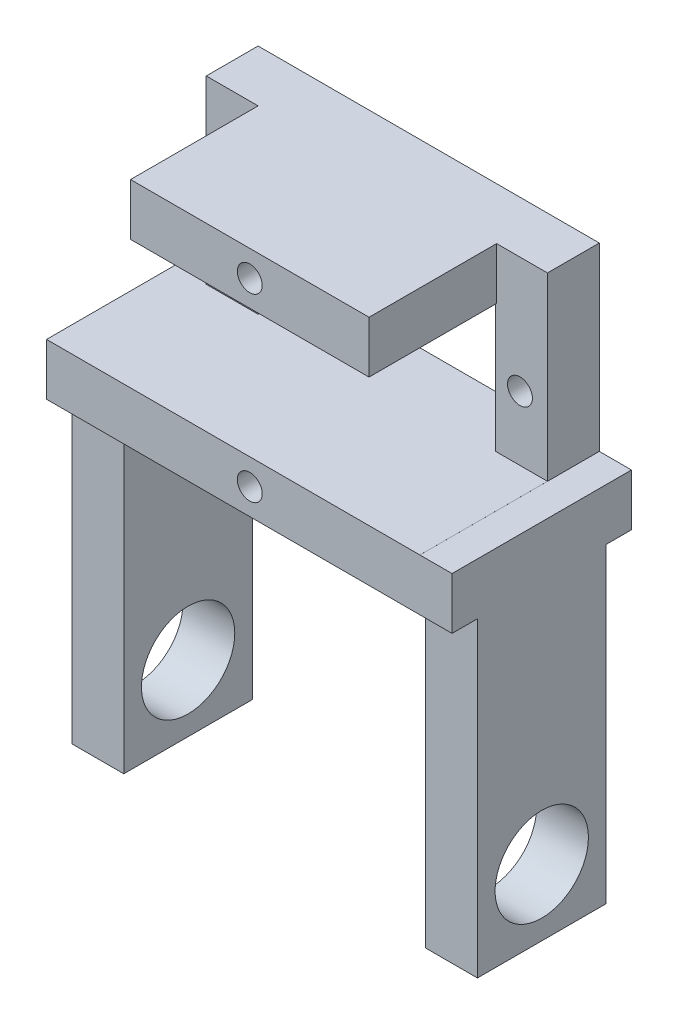
ISO-10303-21;
HEADER;
FILE_DESCRIPTION(('STEP AP214'),'2;1');
FILE_NAME('part.step','',(''),(''),'','','');
FILE_SCHEMA(('AUTOMOTIVE_DESIGN { 1 0 10303 214 1 1 1 1 }'));
ENDSEC;
DATA;
#1=APPLICATION_CONTEXT('core data for automotive mechanical design processes');
#2=APPLICATION_PROTOCOL_DEFINITION('international standard','automotive_design',2000,#1);
#3=PRODUCT_CONTEXT('',#1,'mechanical');
#4=PRODUCT('Part','Part','',(#3));
#5=PRODUCT_RELATED_PRODUCT_CATEGORY('part','',(#4));
#6=PRODUCT_DEFINITION_FORMATION('','',#4);
#7=PRODUCT_DEFINITION_CONTEXT('part definition',#1,'design');
#8=PRODUCT_DEFINITION('design','',#6,#7);
#9=PRODUCT_DEFINITION_SHAPE('','',#8);
#10=(LENGTH_UNIT() NAMED_UNIT(*) SI_UNIT(.MILLI.,.METRE.));
#11=(NAMED_UNIT(*) PLANE_ANGLE_UNIT() SI_UNIT($,.RADIAN.));
#12=(NAMED_UNIT(*) SI_UNIT($,.STERADIAN.) SOLID_ANGLE_UNIT());
#13=UNCERTAINTY_MEASURE_WITH_UNIT(LENGTH_MEASURE(1.E-05),#10,'distance_accuracy_value','');
#14=(GEOMETRIC_REPRESENTATION_CONTEXT(3) GLOBAL_UNCERTAINTY_ASSIGNED_CONTEXT((#13)) GLOBAL_UNIT_ASSIGNED_CONTEXT((#10,
#11,#12)) REPRESENTATION_CONTEXT('',''));
#15=CARTESIAN_POINT('',(0.,0.,0.));
#16=DIRECTION('',(0.,0.,1.));
#17=DIRECTION('',(1.,0.,0.));
#18=AXIS2_PLACEMENT_3D('',#15,#16,#17);
#19=CARTESIAN_POINT('',(-16.45,-11.2,5.));
#20=DIRECTION('',(0.,1.,0.));
#21=DIRECTION('',(0.,0.,1.));
#22=AXIS2_PLACEMENT_3D('',#19,#20,#21);
#23=PLANE('',#22);
#24=DIRECTION('',(-1.,0.,0.));
#25=VECTOR('',#24,1.);
#26=CARTESIAN_POINT('',(14.55,-11.2,14.85));
#27=LINE('',#26,#25);
#28=CARTESIAN_POINT('',(19.55,-11.2,14.85));
#29=VERTEX_POINT('',#28);
#30=CARTESIAN_POINT('',(14.55,-11.2,14.85));
#31=VERTEX_POINT('',#30);
#32=EDGE_CURVE('E303',#29,#31,#27,.T.);
#33=ORIENTED_EDGE('',*,*,#32,.F.);
#34=DIRECTION('',(0.,0.,-1.));
#35=VECTOR('',#34,1.);
#36=CARTESIAN_POINT('',(19.55,-11.2,17.3));
#37=LINE('',#36,#35);
#38=CARTESIAN_POINT('',(19.55,-11.2,17.3));
#39=VERTEX_POINT('',#38);
#40=EDGE_CURVE('E391',#39,#29,#37,.T.);
#41=ORIENTED_EDGE('',*,*,#40,.F.);
#42=DIRECTION('',(1.,0.,0.));
#43=VECTOR('',#42,1.);
#44=CARTESIAN_POINT('',(-11.45,-11.2,17.3));
#45=LINE('',#44,#43);
#46=CARTESIAN_POINT('',(-19.55,-11.2,17.3));
#47=VERTEX_POINT('',#46);
#48=EDGE_CURVE('E440',#47,#39,#45,.T.);
#49=ORIENTED_EDGE('',*,*,#48,.F.);
#50=DIRECTION('',(0.,0.,1.));
#51=VECTOR('',#50,1.);
#52=CARTESIAN_POINT('',(-19.55,-11.2,0.));
#53=LINE('',#52,#51);
#54=CARTESIAN_POINT('',(-19.55,-11.2,14.85));
#55=VERTEX_POINT('',#54);
#56=EDGE_CURVE('E369',#55,#47,#53,.T.);
#57=ORIENTED_EDGE('',*,*,#56,.F.);
#58=DIRECTION('',(-1.,0.,0.));
#59=VECTOR('',#58,1.);
#60=CARTESIAN_POINT('',(-14.55,-11.2,14.85));
#61=LINE('',#60,#59);
#62=CARTESIAN_POINT('',(-14.55,-11.2,14.85));
#63=VERTEX_POINT('',#62);
#64=EDGE_CURVE('E330',#63,#55,#61,.T.);
#65=ORIENTED_EDGE('',*,*,#64,.F.);
#66=DIRECTION('',(0.,0.,1.));
#67=VECTOR('',#66,1.);
#68=CARTESIAN_POINT('',(-14.55,-11.2,2.45));
#69=LINE('',#68,#67);
#70=CARTESIAN_POINT('',(-14.55,-11.2,2.45));
#71=VERTEX_POINT('',#70);
#72=EDGE_CURVE('E343',#71,#63,#69,.T.);
#73=ORIENTED_EDGE('',*,*,#72,.F.);
#74=DIRECTION('',(1.,0.,0.));
#75=VECTOR('',#74,1.);
#76=CARTESIAN_POINT('',(-14.55,-11.2,2.45));
#77=LINE('',#76,#75);
#78=CARTESIAN_POINT('',(-19.55,-11.2,2.45));
#79=VERTEX_POINT('',#78);
#80=EDGE_CURVE('E324',#79,#71,#77,.T.);
#81=ORIENTED_EDGE('',*,*,#80,.F.);
#82=CARTESIAN_POINT('',(-19.55,-11.2,0.));
#83=VERTEX_POINT('',#82);
#84=EDGE_CURVE('E370',#83,#79,#53,.T.);
#85=ORIENTED_EDGE('',*,*,#84,.F.);
#86=DIRECTION('',(1.,0.,0.));
#87=VECTOR('',#86,1.);
#88=CARTESIAN_POINT('',(-16.45,-11.2,0.));
#89=LINE('',#88,#87);
#90=CARTESIAN_POINT('',(19.55,-11.2,0.));
#91=VERTEX_POINT('',#90);
#92=EDGE_CURVE('E549',#83,#91,#89,.T.);
#93=ORIENTED_EDGE('',*,*,#92,.T.);
#94=CARTESIAN_POINT('',(19.55,-11.2,2.45));
#95=VERTEX_POINT('',#94);
#96=EDGE_CURVE('E390',#95,#91,#37,.T.);
#97=ORIENTED_EDGE('',*,*,#96,.F.);
#98=DIRECTION('',(1.,0.,0.));
#99=VECTOR('',#98,1.);
#100=CARTESIAN_POINT('',(14.55,-11.2,2.45));
#101=LINE('',#100,#99);
#102=CARTESIAN_POINT('',(14.55,-11.2,2.45));
#103=VERTEX_POINT('',#102);
#104=EDGE_CURVE('E294',#103,#95,#101,.T.);
#105=ORIENTED_EDGE('',*,*,#104,.F.);
#106=DIRECTION('',(0.,0.,-1.));
#107=VECTOR('',#106,1.);
#108=CARTESIAN_POINT('',(14.55,-11.2,2.45));
#109=LINE('',#108,#107);
#110=EDGE_CURVE('E306',#31,#103,#109,.T.);
#111=ORIENTED_EDGE('',*,*,#110,.F.);
#112=EDGE_LOOP('',(#33,#41,#49,#57,#65,#73,#81,#85,#93,#97,#105,#111));
#113=FACE_BOUND('',#112,.T.);
#114=ADVANCED_FACE('F40',(#113),#23,.F.);
#115=CARTESIAN_POINT('',(-16.45,11.2,5.));
#116=DIRECTION('',(1.,0.,0.));
#117=DIRECTION('',(0.,1.,0.));
#118=AXIS2_PLACEMENT_3D('',#115,#116,#117);
#119=PLANE('',#118);
#120=DIRECTION('',(0.,0.,-1.));
#121=VECTOR('',#120,1.);
#122=CARTESIAN_POINT('',(-16.45,-6.2,0.));
#123=LINE('',#122,#121);
#124=CARTESIAN_POINT('',(-16.45,-6.20000000000001,5.));
#125=VERTEX_POINT('',#124);
#126=CARTESIAN_POINT('',(-16.45,-6.2,0.));
#127=VERTEX_POINT('',#126);
#128=EDGE_CURVE('E11',#125,#127,#123,.T.);
#129=ORIENTED_EDGE('',*,*,#128,.F.);
#130=DIRECTION('',(0.,-1.,0.));
#131=VECTOR('',#130,1.);
#132=CARTESIAN_POINT('',(-16.45,11.2,5.));
#133=LINE('',#132,#131);
#134=CARTESIAN_POINT('',(-16.45,11.2,5.));
#135=VERTEX_POINT('',#134);
#136=EDGE_CURVE('E553',#135,#125,#133,.T.);
#137=ORIENTED_EDGE('',*,*,#136,.F.);
#138=DIRECTION('',(0.,0.,-1.));
#139=VECTOR('',#138,1.);
#140=CARTESIAN_POINT('',(-16.45,11.2,5.));
#141=LINE('',#140,#139);
#142=CARTESIAN_POINT('',(-16.45,11.2,0.));
#143=VERTEX_POINT('',#142);
#144=EDGE_CURVE('E557',#135,#143,#141,.T.);
#145=ORIENTED_EDGE('',*,*,#144,.T.);
#146=DIRECTION('',(0.,-1.,0.));
#147=VECTOR('',#146,1.);
#148=CARTESIAN_POINT('',(-16.45,11.2,0.));
#149=LINE('',#148,#147);
#150=EDGE_CURVE('E563',#143,#127,#149,.T.);
#151=ORIENTED_EDGE('',*,*,#150,.T.);
#152=EDGE_LOOP('',(#129,#137,#145,#151));
#153=FACE_BOUND('',#152,.T.);
#154=ADVANCED_FACE('F590',(#153),#119,.F.);
#155=CARTESIAN_POINT('',(16.45,11.2,5.));
#156=DIRECTION('',(-1.,0.,0.));
#157=DIRECTION('',(0.,0.,1.));
#158=AXIS2_PLACEMENT_3D('',#155,#156,#157);
#159=PLANE('',#158);
#160=DIRECTION('',(0.,0.,1.));
#161=VECTOR('',#160,1.);
#162=CARTESIAN_POINT('',(16.45,-6.20179511261654,17.3));
#163=LINE('',#162,#161);
#164=CARTESIAN_POINT('',(16.45,-6.20179511261654,0.));
#165=VERTEX_POINT('',#164);
#166=CARTESIAN_POINT('',(16.45,-6.20179511261654,17.3));
#167=VERTEX_POINT('',#166);
#168=EDGE_CURVE('E385',#165,#167,#163,.T.);
#169=ORIENTED_EDGE('',*,*,#168,.F.);
#170=DIRECTION('',(0.,1.,0.));
#171=VECTOR('',#170,1.);
#172=CARTESIAN_POINT('',(16.45,11.2,0.));
#173=LINE('',#172,#171);
#174=CARTESIAN_POINT('',(16.45,11.2,0.));
#175=VERTEX_POINT('',#174);
#176=EDGE_CURVE('E534',#165,#175,#173,.T.);
#177=ORIENTED_EDGE('',*,*,#176,.T.);
#178=DIRECTION('',(0.,0.,-1.));
#179=VECTOR('',#178,1.);
#180=CARTESIAN_POINT('',(16.45,11.2,5.));
#181=LINE('',#180,#179);
#182=CARTESIAN_POINT('',(16.45,11.2,5.));
#183=VERTEX_POINT('',#182);
#184=EDGE_CURVE('E470',#183,#175,#181,.T.);
#185=ORIENTED_EDGE('',*,*,#184,.F.);
#186=DIRECTION('',(0.,1.,0.));
#187=VECTOR('',#186,1.);
#188=CARTESIAN_POINT('',(16.45,11.2,5.));
#189=LINE('',#188,#187);
#190=CARTESIAN_POINT('',(16.45,-6.2,5.));
#191=VERTEX_POINT('',#190);
#192=EDGE_CURVE('E545',#191,#183,#189,.T.);
#193=ORIENTED_EDGE('',*,*,#192,.F.);
#194=DIRECTION('',(0.,0.,-1.));
#195=VECTOR('',#194,1.);
#196=CARTESIAN_POINT('',(16.45,-6.2,17.3));
#197=LINE('',#196,#195);
#198=CARTESIAN_POINT('',(16.45,-6.2,17.3));
#199=VERTEX_POINT('',#198);
#200=EDGE_CURVE('E415',#199,#191,#197,.T.);
#201=ORIENTED_EDGE('',*,*,#200,.F.);
#202=DIRECTION('',(0.,1.,0.));
#203=VECTOR('',#202,1.);
#204=CARTESIAN_POINT('',(16.45,-11.2,17.3));
#205=LINE('',#204,#203);
#206=EDGE_CURVE('E412',#167,#199,#205,.T.);
#207=ORIENTED_EDGE('',*,*,#206,.F.);
#208=EDGE_LOOP('',(#169,#177,#185,#193,#201,#207));
#209=FACE_BOUND('',#208,.T.);
#210=ADVANCED_FACE('F42',(#209),#159,.F.);
#211=CARTESIAN_POINT('',(0.,0.,5.));
#212=DIRECTION('',(0.,0.,1.));
#213=DIRECTION('',(1.,0.,0.));
#214=AXIS2_PLACEMENT_3D('',#211,#212,#213);
#215=PLANE('',#214);
#216=CARTESIAN_POINT('',(13.8,0.,5.));
#217=DIRECTION('',(0.,0.,1.));
#218=DIRECTION('',(1.,0.,0.));
#219=AXIS2_PLACEMENT_3D('',#216,#217,#218);
#220=CIRCLE('',#219,1.2);
#221=CARTESIAN_POINT('',(15.,0.,5.));
#222=VERTEX_POINT('',#221);
#223=EDGE_CURVE('E495',#222,#222,#220,.T.);
#224=ORIENTED_EDGE('',*,*,#223,.F.);
#225=EDGE_LOOP('',(#224));
#226=FACE_BOUND('',#225,.T.);
#227=DIRECTION('',(-1.,0.,0.));
#228=VECTOR('',#227,1.);
#229=CARTESIAN_POINT('',(-11.45,-6.2,5.));
#230=LINE('',#229,#228);
#231=CARTESIAN_POINT('',(11.45,-6.2,5.));
#232=VERTEX_POINT('',#231);
#233=EDGE_CURVE('E428',#191,#232,#230,.T.);
#234=ORIENTED_EDGE('',*,*,#233,.F.);
#235=ORIENTED_EDGE('',*,*,#192,.T.);
#236=DIRECTION('',(-1.,0.,0.));
#237=VECTOR('',#236,1.);
#238=CARTESIAN_POINT('',(-16.45,11.2,5.));
#239=LINE('',#238,#237);
#240=CARTESIAN_POINT('',(11.546888994161,11.2,5.));
#241=VERTEX_POINT('',#240);
#242=EDGE_CURVE('E550',#183,#241,#239,.T.);
#243=ORIENTED_EDGE('',*,*,#242,.T.);
#244=DIRECTION('',(0.,1.,0.));
#245=VECTOR('',#244,1.);
#246=CARTESIAN_POINT('',(11.546888994161,6.2,5.));
#247=LINE('',#246,#245);
#248=CARTESIAN_POINT('',(11.546888994161,6.2,5.));
#249=VERTEX_POINT('',#248);
#250=EDGE_CURVE('E454',#249,#241,#247,.T.);
#251=ORIENTED_EDGE('',*,*,#250,.F.);
#252=DIRECTION('',(1.,0.,0.));
#253=VECTOR('',#252,1.);
#254=CARTESIAN_POINT('',(-11.45,6.2,5.));
#255=LINE('',#254,#253);
#256=CARTESIAN_POINT('',(11.45,6.2,5.));
#257=VERTEX_POINT('',#256);
#258=EDGE_CURVE('E50',#257,#249,#255,.T.);
#259=ORIENTED_EDGE('',*,*,#258,.F.);
#260=DIRECTION('',(0.,1.,0.));
#261=VECTOR('',#260,1.);
#262=CARTESIAN_POINT('',(11.45,6.2,5.));
#263=LINE('',#262,#261);
#264=EDGE_CURVE('E494',#232,#257,#263,.T.);
#265=ORIENTED_EDGE('',*,*,#264,.F.);
#266=EDGE_LOOP('',(#234,#235,#243,#251,#259,#265));
#267=FACE_BOUND('',#266,.T.);
#268=ADVANCED_FACE('F644',(#226,#267),#215,.T.);
#269=CARTESIAN_POINT('',(-13.8,0.,5.));
#270=DIRECTION('',(0.,0.,1.));
#271=DIRECTION('',(1.,0.,0.));
#272=AXIS2_PLACEMENT_3D('',#269,#270,#271);
#273=CIRCLE('',#272,1.2);
#274=CARTESIAN_POINT('',(-12.6,0.,5.));
#275=VERTEX_POINT('',#274);
#276=EDGE_CURVE('E489',#275,#275,#273,.T.);
#277=ORIENTED_EDGE('',*,*,#276,.F.);
#278=EDGE_LOOP('',(#277));
#279=FACE_BOUND('',#278,.T.);
#280=ORIENTED_EDGE('',*,*,#136,.T.);
#281=DIRECTION('',(-1.,0.,0.));
#282=VECTOR('',#281,1.);
#283=CARTESIAN_POINT('',(-16.45,-6.20000000000001,5.));
#284=LINE('',#283,#282);
#285=CARTESIAN_POINT('',(-11.45,-6.20000000000001,5.));
#286=VERTEX_POINT('',#285);
#287=EDGE_CURVE('E419',#286,#125,#284,.T.);
#288=ORIENTED_EDGE('',*,*,#287,.F.);
#289=DIRECTION('',(0.,-1.,0.));
#290=VECTOR('',#289,1.);
#291=CARTESIAN_POINT('',(-11.45,6.2,5.));
#292=LINE('',#291,#290);
#293=CARTESIAN_POINT('',(-11.45,6.2,5.));
#294=VERTEX_POINT('',#293);
#295=EDGE_CURVE('E511',#294,#286,#292,.T.);
#296=ORIENTED_EDGE('',*,*,#295,.F.);
#297=DIRECTION('',(0.,-1.,0.));
#298=VECTOR('',#297,1.);
#299=CARTESIAN_POINT('',(-11.45,6.2,5.));
#300=LINE('',#299,#298);
#301=CARTESIAN_POINT('',(-11.45,11.2,5.));
#302=VERTEX_POINT('',#301);
#303=EDGE_CURVE('E446',#302,#294,#300,.T.);
#304=ORIENTED_EDGE('',*,*,#303,.F.);
#305=EDGE_CURVE('E548',#302,#135,#239,.T.);
#306=ORIENTED_EDGE('',*,*,#305,.T.);
#307=EDGE_LOOP('',(#280,#288,#296,#304,#306));
#308=FACE_BOUND('',#307,.T.);
#309=ADVANCED_FACE('F598',(#279,#308),#215,.T.);
#310=CARTESIAN_POINT('',(-16.45,11.2,5.));
#311=DIRECTION('',(0.,-1.,0.));
#312=DIRECTION('',(0.,0.,-1.));
#313=AXIS2_PLACEMENT_3D('',#310,#311,#312);
#314=PLANE('',#313);
#315=DIRECTION('',(-1.,0.,0.));
#316=VECTOR('',#315,1.);
#317=CARTESIAN_POINT('',(-16.45,11.2,0.));
#318=LINE('',#317,#316);
#319=EDGE_CURVE('E560',#175,#143,#318,.T.);
#320=ORIENTED_EDGE('',*,*,#319,.T.);
#321=ORIENTED_EDGE('',*,*,#144,.F.);
#322=ORIENTED_EDGE('',*,*,#305,.F.);
#323=DIRECTION('',(0.,0.,-1.));
#324=VECTOR('',#323,1.);
#325=CARTESIAN_POINT('',(-11.45,11.2,17.3));
#326=LINE('',#325,#324);
#327=CARTESIAN_POINT('',(-11.45,11.2,17.3));
#328=VERTEX_POINT('',#327);
#329=EDGE_CURVE('E463',#328,#302,#326,.T.);
#330=ORIENTED_EDGE('',*,*,#329,.F.);
#331=DIRECTION('',(-1.,0.,0.));
#332=VECTOR('',#331,1.);
#333=CARTESIAN_POINT('',(-11.45,11.2,17.3));
#334=LINE('',#333,#332);
#335=CARTESIAN_POINT('',(11.546888994161,11.2,17.3));
#336=VERTEX_POINT('',#335);
#337=EDGE_CURVE('E460',#336,#328,#334,.T.);
#338=ORIENTED_EDGE('',*,*,#337,.F.);
#339=DIRECTION('',(0.,0.,-1.));
#340=VECTOR('',#339,1.);
#341=CARTESIAN_POINT('',(11.546888994161,11.2,17.3));
#342=LINE('',#341,#340);
#343=EDGE_CURVE('E477',#336,#241,#342,.T.);
#344=ORIENTED_EDGE('',*,*,#343,.T.);
#345=ORIENTED_EDGE('',*,*,#242,.F.);
#346=ORIENTED_EDGE('',*,*,#184,.T.);
#347=EDGE_LOOP('',(#320,#321,#322,#330,#338,#344,#345,#346));
#348=FACE_BOUND('',#347,.T.);
#349=ADVANCED_FACE('F576',(#348),#314,.F.);
#350=CARTESIAN_POINT('',(0.,0.,0.));
#351=DIRECTION('',(0.,0.,1.));
#352=DIRECTION('',(1.,0.,0.));
#353=AXIS2_PLACEMENT_3D('',#350,#351,#352);
#354=PLANE('',#353);
#355=CARTESIAN_POINT('',(-13.8,0.,0.));
#356=DIRECTION('',(0.,0.,1.));
#357=DIRECTION('',(1.,0.,0.));
#358=AXIS2_PLACEMENT_3D('',#355,#356,#357);
#359=CIRCLE('',#358,1.2);
#360=CARTESIAN_POINT('',(-12.6,0.,0.));
#361=VERTEX_POINT('',#360);
#362=EDGE_CURVE('E499',#361,#361,#359,.T.);
#363=ORIENTED_EDGE('',*,*,#362,.T.);
#364=EDGE_LOOP('',(#363));
#365=FACE_BOUND('',#364,.T.);
#366=CARTESIAN_POINT('',(13.8,0.,0.));
#367=DIRECTION('',(0.,0.,1.));
#368=DIRECTION('',(1.,0.,0.));
#369=AXIS2_PLACEMENT_3D('',#366,#367,#368);
#370=CIRCLE('',#369,1.2);
#371=CARTESIAN_POINT('',(15.,0.,0.));
#372=VERTEX_POINT('',#371);
#373=EDGE_CURVE('E490',#372,#372,#370,.T.);
#374=ORIENTED_EDGE('',*,*,#373,.T.);
#375=EDGE_LOOP('',(#374));
#376=FACE_BOUND('',#375,.T.);
#377=DIRECTION('',(1.,0.,0.));
#378=VECTOR('',#377,1.);
#379=CARTESIAN_POINT('',(-11.45,-6.2,0.));
#380=LINE('',#379,#378);
#381=CARTESIAN_POINT('',(-11.45,-6.2,0.));
#382=VERTEX_POINT('',#381);
#383=CARTESIAN_POINT('',(11.45,-6.2,0.));
#384=VERTEX_POINT('',#383);
#385=EDGE_CURVE('E519',#382,#384,#380,.T.);
#386=ORIENTED_EDGE('',*,*,#385,.T.);
#387=DIRECTION('',(0.,1.,0.));
#388=VECTOR('',#387,1.);
#389=CARTESIAN_POINT('',(11.45,6.2,0.));
#390=LINE('',#389,#388);
#391=CARTESIAN_POINT('',(11.45,6.2,0.));
#392=VERTEX_POINT('',#391);
#393=EDGE_CURVE('E506',#384,#392,#390,.T.);
#394=ORIENTED_EDGE('',*,*,#393,.T.);
#395=DIRECTION('',(-1.,0.,0.));
#396=VECTOR('',#395,1.);
#397=CARTESIAN_POINT('',(-11.45,6.2,0.));
#398=LINE('',#397,#396);
#399=CARTESIAN_POINT('',(-11.45,6.2,0.));
#400=VERTEX_POINT('',#399);
#401=EDGE_CURVE('E510',#392,#400,#398,.T.);
#402=ORIENTED_EDGE('',*,*,#401,.T.);
#403=DIRECTION('',(0.,-1.,0.));
#404=VECTOR('',#403,1.);
#405=CARTESIAN_POINT('',(-11.45,6.2,0.));
#406=LINE('',#405,#404);
#407=EDGE_CURVE('E515',#400,#382,#406,.T.);
#408=ORIENTED_EDGE('',*,*,#407,.T.);
#409=EDGE_LOOP('',(#386,#394,#402,#408));
#410=FACE_BOUND('',#409,.T.);
#411=ORIENTED_EDGE('',*,*,#176,.F.);
#412=DIRECTION('',(-1.,0.,0.));
#413=VECTOR('',#412,1.);
#414=CARTESIAN_POINT('',(19.55,-6.20179511261654,0.));
#415=LINE('',#414,#413);
#416=CARTESIAN_POINT('',(19.55,-6.20179511261654,0.));
#417=VERTEX_POINT('',#416);
#418=EDGE_CURVE('E408',#417,#165,#415,.T.);
#419=ORIENTED_EDGE('',*,*,#418,.F.);
#420=DIRECTION('',(0.,1.,0.));
#421=VECTOR('',#420,1.);
#422=CARTESIAN_POINT('',(19.55,-11.2,0.));
#423=LINE('',#422,#421);
#424=EDGE_CURVE('E395',#91,#417,#423,.T.);
#425=ORIENTED_EDGE('',*,*,#424,.F.);
#426=ORIENTED_EDGE('',*,*,#92,.F.);
#427=DIRECTION('',(0.,-1.,0.));
#428=VECTOR('',#427,1.);
#429=CARTESIAN_POINT('',(-19.55,-11.2,0.));
#430=LINE('',#429,#428);
#431=CARTESIAN_POINT('',(-19.55,-6.2,0.));
#432=VERTEX_POINT('',#431);
#433=EDGE_CURVE('E365',#432,#83,#430,.T.);
#434=ORIENTED_EDGE('',*,*,#433,.F.);
#435=DIRECTION('',(1.,0.,0.));
#436=VECTOR('',#435,1.);
#437=CARTESIAN_POINT('',(-19.55,-6.2,0.));
#438=LINE('',#437,#436);
#439=EDGE_CURVE('E380',#432,#127,#438,.T.);
#440=ORIENTED_EDGE('',*,*,#439,.T.);
#441=ORIENTED_EDGE('',*,*,#150,.F.);
#442=ORIENTED_EDGE('',*,*,#319,.F.);
#443=EDGE_LOOP('',(#411,#419,#425,#426,#434,#440,#441,#442));
#444=FACE_BOUND('',#443,.T.);
#445=ADVANCED_FACE('F586',(#365,#376,#410,#444),#354,.F.);
#446=CARTESIAN_POINT('',(11.45,6.2,0.));
#447=DIRECTION('',(1.,0.,0.));
#448=DIRECTION('',(0.,0.,-1.));
#449=AXIS2_PLACEMENT_3D('',#446,#447,#448);
#450=PLANE('',#449);
#451=ORIENTED_EDGE('',*,*,#264,.T.);
#452=DIRECTION('',(0.,0.,1.));
#453=VECTOR('',#452,1.);
#454=CARTESIAN_POINT('',(11.45,6.2,0.));
#455=LINE('',#454,#453);
#456=EDGE_CURVE('E523',#392,#257,#455,.T.);
#457=ORIENTED_EDGE('',*,*,#456,.F.);
#458=ORIENTED_EDGE('',*,*,#393,.F.);
#459=DIRECTION('',(0.,0.,1.));
#460=VECTOR('',#459,1.);
#461=CARTESIAN_POINT('',(11.45,-6.2,0.));
#462=LINE('',#461,#460);
#463=EDGE_CURVE('E530',#384,#232,#462,.T.);
#464=ORIENTED_EDGE('',*,*,#463,.T.);
#465=EDGE_LOOP('',(#451,#457,#458,#464));
#466=FACE_BOUND('',#465,.T.);
#467=ADVANCED_FACE('F642',(#466),#450,.F.);
#468=CARTESIAN_POINT('',(-11.45,-6.2,0.));
#469=DIRECTION('',(0.,-1.,0.));
#470=DIRECTION('',(0.,0.,-1.));
#471=AXIS2_PLACEMENT_3D('',#468,#469,#470);
#472=PLANE('',#471);
#473=DIRECTION('',(0.,0.,1.));
#474=VECTOR('',#473,1.);
#475=CARTESIAN_POINT('',(-11.45,-6.2,0.));
#476=LINE('',#475,#474);
#477=EDGE_CURVE('E535',#382,#286,#476,.T.);
#478=ORIENTED_EDGE('',*,*,#477,.T.);
#479=ORIENTED_EDGE('',*,*,#287,.T.);
#480=ORIENTED_EDGE('',*,*,#128,.T.);
#481=ORIENTED_EDGE('',*,*,#439,.F.);
#482=DIRECTION('',(0.,0.,-1.));
#483=VECTOR('',#482,1.);
#484=CARTESIAN_POINT('',(-19.55,-6.2,0.));
#485=LINE('',#484,#483);
#486=CARTESIAN_POINT('',(-19.55,-6.2,17.3));
#487=VERTEX_POINT('',#486);
#488=EDGE_CURVE('E378',#487,#432,#485,.T.);
#489=ORIENTED_EDGE('',*,*,#488,.F.);
#490=DIRECTION('',(-1.,0.,0.));
#491=VECTOR('',#490,1.);
#492=CARTESIAN_POINT('',(-11.45,-6.2,17.3));
#493=LINE('',#492,#491);
#494=EDGE_CURVE('E443',#199,#487,#493,.T.);
#495=ORIENTED_EDGE('',*,*,#494,.F.);
#496=ORIENTED_EDGE('',*,*,#200,.T.);
#497=ORIENTED_EDGE('',*,*,#233,.T.);
#498=ORIENTED_EDGE('',*,*,#463,.F.);
#499=ORIENTED_EDGE('',*,*,#385,.F.);
#500=EDGE_LOOP('',(#478,#479,#480,#481,#489,#495,#496,#497,#498,#499));
#501=FACE_BOUND('',#500,.T.);
#502=ADVANCED_FACE('F593',(#501),#472,.F.);
#503=CARTESIAN_POINT('',(-11.45,6.2,0.));
#504=DIRECTION('',(-1.,0.,0.));
#505=DIRECTION('',(0.,0.,1.));
#506=AXIS2_PLACEMENT_3D('',#503,#504,#505);
#507=PLANE('',#506);
#508=ORIENTED_EDGE('',*,*,#295,.T.);
#509=ORIENTED_EDGE('',*,*,#477,.F.);
#510=ORIENTED_EDGE('',*,*,#407,.F.);
#511=DIRECTION('',(0.,0.,1.));
#512=VECTOR('',#511,1.);
#513=CARTESIAN_POINT('',(-11.45,6.2,0.));
#514=LINE('',#513,#512);
#515=EDGE_CURVE('E539',#400,#294,#514,.T.);
#516=ORIENTED_EDGE('',*,*,#515,.T.);
#517=EDGE_LOOP('',(#508,#509,#510,#516));
#518=FACE_BOUND('',#517,.T.);
#519=ADVANCED_FACE('F659',(#518),#507,.F.);
#520=CARTESIAN_POINT('',(-11.45,6.2,0.));
#521=DIRECTION('',(0.,1.,0.));
#522=DIRECTION('',(0.,0.,1.));
#523=AXIS2_PLACEMENT_3D('',#520,#521,#522);
#524=PLANE('',#523);
#525=ORIENTED_EDGE('',*,*,#456,.T.);
#526=ORIENTED_EDGE('',*,*,#258,.T.);
#527=DIRECTION('',(0.,0.,-1.));
#528=VECTOR('',#527,1.);
#529=CARTESIAN_POINT('',(11.546888994161,6.2,17.3));
#530=LINE('',#529,#528);
#531=CARTESIAN_POINT('',(11.546888994161,6.2,17.3));
#532=VERTEX_POINT('',#531);
#533=EDGE_CURVE('E481',#532,#249,#530,.T.);
#534=ORIENTED_EDGE('',*,*,#533,.F.);
#535=DIRECTION('',(1.,0.,0.));
#536=VECTOR('',#535,1.);
#537=CARTESIAN_POINT('',(-11.45,6.2,17.3));
#538=LINE('',#537,#536);
#539=CARTESIAN_POINT('',(-11.45,6.2,17.3));
#540=VERTEX_POINT('',#539);
#541=EDGE_CURVE('E453',#540,#532,#538,.T.);
#542=ORIENTED_EDGE('',*,*,#541,.F.);
#543=DIRECTION('',(0.,0.,-1.));
#544=VECTOR('',#543,1.);
#545=CARTESIAN_POINT('',(-11.45,6.2,17.3));
#546=LINE('',#545,#544);
#547=EDGE_CURVE('E485',#540,#294,#546,.T.);
#548=ORIENTED_EDGE('',*,*,#547,.T.);
#549=ORIENTED_EDGE('',*,*,#515,.F.);
#550=ORIENTED_EDGE('',*,*,#401,.F.);
#551=EDGE_LOOP('',(#525,#526,#534,#542,#548,#549,#550));
#552=FACE_BOUND('',#551,.T.);
#553=ADVANCED_FACE('F655',(#552),#524,.F.);
#554=CARTESIAN_POINT('',(13.8,0.,0.));
#555=DIRECTION('',(0.,0.,1.));
#556=DIRECTION('',(1.,0.,0.));
#557=AXIS2_PLACEMENT_3D('',#554,#555,#556);
#558=CYLINDRICAL_SURFACE('',#557,1.2);
#559=ORIENTED_EDGE('',*,*,#373,.F.);
#560=EDGE_LOOP('',(#559));
#561=FACE_BOUND('',#560,.T.);
#562=ORIENTED_EDGE('',*,*,#223,.T.);
#563=EDGE_LOOP('',(#562));
#564=FACE_BOUND('',#563,.T.);
#565=ADVANCED_FACE('F658',(#561,#564),#558,.F.);
#566=CARTESIAN_POINT('',(-13.8,0.,0.));
#567=DIRECTION('',(0.,0.,1.));
#568=DIRECTION('',(1.,0.,0.));
#569=AXIS2_PLACEMENT_3D('',#566,#567,#568);
#570=CYLINDRICAL_SURFACE('',#569,1.2);
#571=ORIENTED_EDGE('',*,*,#362,.F.);
#572=EDGE_LOOP('',(#571));
#573=FACE_BOUND('',#572,.T.);
#574=ORIENTED_EDGE('',*,*,#276,.T.);
#575=EDGE_LOOP('',(#574));
#576=FACE_BOUND('',#575,.T.);
#577=ADVANCED_FACE('F666',(#573,#576),#570,.F.);
#578=CARTESIAN_POINT('',(-11.45,6.2,17.3));
#579=DIRECTION('',(1.,0.,0.));
#580=DIRECTION('',(0.,0.,-1.));
#581=AXIS2_PLACEMENT_3D('',#578,#579,#580);
#582=PLANE('',#581);
#583=ORIENTED_EDGE('',*,*,#303,.T.);
#584=ORIENTED_EDGE('',*,*,#547,.F.);
#585=DIRECTION('',(0.,-1.,0.));
#586=VECTOR('',#585,1.);
#587=CARTESIAN_POINT('',(-11.45,6.2,17.3));
#588=LINE('',#587,#586);
#589=EDGE_CURVE('E449',#328,#540,#588,.T.);
#590=ORIENTED_EDGE('',*,*,#589,.F.);
#591=ORIENTED_EDGE('',*,*,#329,.T.);
#592=EDGE_LOOP('',(#583,#584,#590,#591));
#593=FACE_BOUND('',#592,.T.);
#594=ADVANCED_FACE('F669',(#593),#582,.F.);
#595=CARTESIAN_POINT('',(11.546888994161,6.2,17.3));
#596=DIRECTION('',(-1.,0.,0.));
#597=DIRECTION('',(0.,0.,1.));
#598=AXIS2_PLACEMENT_3D('',#595,#596,#597);
#599=PLANE('',#598);
#600=ORIENTED_EDGE('',*,*,#250,.T.);
#601=ORIENTED_EDGE('',*,*,#343,.F.);
#602=DIRECTION('',(0.,1.,0.));
#603=VECTOR('',#602,1.);
#604=CARTESIAN_POINT('',(11.546888994161,6.2,17.3));
#605=LINE('',#604,#603);
#606=EDGE_CURVE('E457',#532,#336,#605,.T.);
#607=ORIENTED_EDGE('',*,*,#606,.F.);
#608=ORIENTED_EDGE('',*,*,#533,.T.);
#609=EDGE_LOOP('',(#600,#601,#607,#608));
#610=FACE_BOUND('',#609,.T.);
#611=ADVANCED_FACE('F676',(#610),#599,.F.);
#612=CARTESIAN_POINT('',(0.,0.,17.3));
#613=DIRECTION('',(0.,0.,-1.));
#614=DIRECTION('',(-1.,0.,0.));
#615=AXIS2_PLACEMENT_3D('',#612,#613,#614);
#616=PLANE('',#615);
#617=CARTESIAN_POINT('',(0.0484444970805025,8.7,17.3));
#618=DIRECTION('',(0.,0.,1.));
#619=DIRECTION('',(1.,0.,0.));
#620=AXIS2_PLACEMENT_3D('',#617,#618,#619);
#621=CIRCLE('',#620,1.2);
#622=CARTESIAN_POINT('',(1.2484444970805,8.7,17.3));
#623=VERTEX_POINT('',#622);
#624=EDGE_CURVE('E429',#623,#623,#621,.T.);
#625=ORIENTED_EDGE('',*,*,#624,.F.);
#626=EDGE_LOOP('',(#625));
#627=FACE_BOUND('',#626,.T.);
#628=ORIENTED_EDGE('',*,*,#589,.T.);
#629=ORIENTED_EDGE('',*,*,#541,.T.);
#630=ORIENTED_EDGE('',*,*,#606,.T.);
#631=ORIENTED_EDGE('',*,*,#337,.T.);
#632=EDGE_LOOP('',(#628,#629,#630,#631));
#633=FACE_BOUND('',#632,.T.);
#634=ADVANCED_FACE('F680',(#627,#633),#616,.F.);
#635=CARTESIAN_POINT('',(0.,0.,17.3));
#636=DIRECTION('',(0.,0.,1.));
#637=DIRECTION('',(1.,0.,0.));
#638=AXIS2_PLACEMENT_3D('',#635,#636,#637);
#639=PLANE('',#638);
#640=CARTESIAN_POINT('',(0.0484444970805025,-8.7,17.3));
#641=DIRECTION('',(0.,0.,1.));
#642=DIRECTION('',(1.,0.,0.));
#643=AXIS2_PLACEMENT_3D('',#640,#641,#642);
#644=CIRCLE('',#643,1.2);
#645=CARTESIAN_POINT('',(1.2484444970805,-8.7,17.3));
#646=VERTEX_POINT('',#645);
#647=EDGE_CURVE('E423',#646,#646,#644,.T.);
#648=ORIENTED_EDGE('',*,*,#647,.F.);
#649=EDGE_LOOP('',(#648));
#650=FACE_BOUND('',#649,.T.);
#651=ORIENTED_EDGE('',*,*,#494,.T.);
#652=DIRECTION('',(0.,1.,0.));
#653=VECTOR('',#652,1.);
#654=CARTESIAN_POINT('',(-19.55,-11.2,17.3));
#655=LINE('',#654,#653);
#656=EDGE_CURVE('E374',#47,#487,#655,.T.);
#657=ORIENTED_EDGE('',*,*,#656,.F.);
#658=ORIENTED_EDGE('',*,*,#48,.T.);
#659=DIRECTION('',(0.,-1.,0.));
#660=VECTOR('',#659,1.);
#661=CARTESIAN_POINT('',(19.55,-11.2,17.3));
#662=LINE('',#661,#660);
#663=CARTESIAN_POINT('',(19.55,-6.20179511261654,17.3));
#664=VERTEX_POINT('',#663);
#665=EDGE_CURVE('E386',#664,#39,#662,.T.);
#666=ORIENTED_EDGE('',*,*,#665,.F.);
#667=DIRECTION('',(-1.,0.,0.));
#668=VECTOR('',#667,1.);
#669=CARTESIAN_POINT('',(19.55,-6.20179511261654,17.3));
#670=LINE('',#669,#668);
#671=EDGE_CURVE('E401',#664,#167,#670,.T.);
#672=ORIENTED_EDGE('',*,*,#671,.T.);
#673=ORIENTED_EDGE('',*,*,#206,.T.);
#674=EDGE_LOOP('',(#651,#657,#658,#666,#672,#673));
#675=FACE_BOUND('',#674,.T.);
#676=ADVANCED_FACE('F684',(#650,#675),#639,.T.);
#677=CARTESIAN_POINT('',(0.0484444970805025,-8.7,12.3));
#678=DIRECTION('',(0.,0.,1.));
#679=DIRECTION('',(1.,0.,0.));
#680=AXIS2_PLACEMENT_3D('',#677,#678,#679);
#681=CYLINDRICAL_SURFACE('',#680,1.2);
#682=CARTESIAN_POINT('',(0.0484444970805025,-8.7,12.3));
#683=DIRECTION('',(0.,0.,1.));
#684=DIRECTION('',(1.,0.,0.));
#685=AXIS2_PLACEMENT_3D('',#682,#683,#684);
#686=CIRCLE('',#685,1.2);
#687=CARTESIAN_POINT('',(1.2484444970805,-8.7,12.3));
#688=VERTEX_POINT('',#687);
#689=EDGE_CURVE('E433',#688,#688,#686,.T.);
#690=ORIENTED_EDGE('',*,*,#689,.F.);
#691=EDGE_LOOP('',(#690));
#692=FACE_BOUND('',#691,.T.);
#693=ORIENTED_EDGE('',*,*,#647,.T.);
#694=EDGE_LOOP('',(#693));
#695=FACE_BOUND('',#694,.T.);
#696=ADVANCED_FACE('F688',(#692,#695),#681,.F.);
#697=CARTESIAN_POINT('',(0.0484444970805025,-8.7,12.3));
#698=DIRECTION('',(0.,0.,1.));
#699=DIRECTION('',(1.,0.,0.));
#700=AXIS2_PLACEMENT_3D('',#697,#698,#699);
#701=PLANE('',#700);
#702=ORIENTED_EDGE('',*,*,#689,.T.);
#703=EDGE_LOOP('',(#702));
#704=FACE_BOUND('',#703,.T.);
#705=ADVANCED_FACE('F692',(#704),#701,.T.);
#706=CARTESIAN_POINT('',(0.0484444970805025,8.7,12.3));
#707=DIRECTION('',(0.,0.,1.));
#708=DIRECTION('',(1.,0.,0.));
#709=AXIS2_PLACEMENT_3D('',#706,#707,#708);
#710=CYLINDRICAL_SURFACE('',#709,1.2);
#711=CARTESIAN_POINT('',(0.0484444970805025,8.7,12.3));
#712=DIRECTION('',(0.,0.,1.));
#713=DIRECTION('',(1.,0.,0.));
#714=AXIS2_PLACEMENT_3D('',#711,#712,#713);
#715=CIRCLE('',#714,1.2);
#716=CARTESIAN_POINT('',(1.2484444970805,8.7,12.3));
#717=VERTEX_POINT('',#716);
#718=EDGE_CURVE('E424',#717,#717,#715,.T.);
#719=ORIENTED_EDGE('',*,*,#718,.F.);
#720=EDGE_LOOP('',(#719));
#721=FACE_BOUND('',#720,.T.);
#722=ORIENTED_EDGE('',*,*,#624,.T.);
#723=EDGE_LOOP('',(#722));
#724=FACE_BOUND('',#723,.T.);
#725=ADVANCED_FACE('F696',(#721,#724),#710,.F.);
#726=CARTESIAN_POINT('',(0.0484444970805025,8.7,12.3));
#727=DIRECTION('',(0.,0.,1.));
#728=DIRECTION('',(1.,0.,0.));
#729=AXIS2_PLACEMENT_3D('',#726,#727,#728);
#730=PLANE('',#729);
#731=ORIENTED_EDGE('',*,*,#718,.T.);
#732=EDGE_LOOP('',(#731));
#733=FACE_BOUND('',#732,.T.);
#734=ADVANCED_FACE('F700',(#733),#730,.T.);
#735=CARTESIAN_POINT('',(19.55,-6.20179511261654,17.3));
#736=DIRECTION('',(0.,-1.,0.));
#737=DIRECTION('',(1.,0.,0.));
#738=AXIS2_PLACEMENT_3D('',#735,#736,#737);
#739=PLANE('',#738);
#740=ORIENTED_EDGE('',*,*,#168,.T.);
#741=ORIENTED_EDGE('',*,*,#671,.F.);
#742=DIRECTION('',(0.,0.,1.));
#743=VECTOR('',#742,1.);
#744=CARTESIAN_POINT('',(19.55,-6.20179511261654,17.3));
#745=LINE('',#744,#743);
#746=EDGE_CURVE('E398',#417,#664,#745,.T.);
#747=ORIENTED_EDGE('',*,*,#746,.F.);
#748=ORIENTED_EDGE('',*,*,#418,.T.);
#749=EDGE_LOOP('',(#740,#741,#747,#748));
#750=FACE_BOUND('',#749,.T.);
#751=ADVANCED_FACE('F704',(#750),#739,.F.);
#752=CARTESIAN_POINT('',(19.55,0.,0.));
#753=DIRECTION('',(-1.,0.,0.));
#754=DIRECTION('',(0.,0.,1.));
#755=AXIS2_PLACEMENT_3D('',#752,#753,#754);
#756=PLANE('',#755);
#757=CARTESIAN_POINT('',(19.55,-34.8,8.65));
#758=DIRECTION('',(1.,0.,0.));
#759=DIRECTION('',(0.,0.,-1.));
#760=AXIS2_PLACEMENT_3D('',#757,#758,#759);
#761=CIRCLE('',#760,4.5);
#762=CARTESIAN_POINT('',(19.55,-34.8,4.15));
#763=VERTEX_POINT('',#762);
#764=EDGE_CURVE('E285',#763,#763,#761,.T.);
#765=ORIENTED_EDGE('',*,*,#764,.F.);
#766=EDGE_LOOP('',(#765));
#767=FACE_BOUND('',#766,.T.);
#768=DIRECTION('',(0.,1.,0.));
#769=VECTOR('',#768,1.);
#770=CARTESIAN_POINT('',(19.55,-41.2,2.45));
#771=LINE('',#770,#769);
#772=CARTESIAN_POINT('',(19.55,-41.2,2.45));
#773=VERTEX_POINT('',#772);
#774=EDGE_CURVE('E66',#773,#95,#771,.T.);
#775=ORIENTED_EDGE('',*,*,#774,.T.);
#776=ORIENTED_EDGE('',*,*,#96,.T.);
#777=ORIENTED_EDGE('',*,*,#424,.T.);
#778=ORIENTED_EDGE('',*,*,#746,.T.);
#779=ORIENTED_EDGE('',*,*,#665,.T.);
#780=ORIENTED_EDGE('',*,*,#40,.T.);
#781=DIRECTION('',(0.,1.,0.));
#782=VECTOR('',#781,1.);
#783=CARTESIAN_POINT('',(19.55,-41.2,14.85));
#784=LINE('',#783,#782);
#785=CARTESIAN_POINT('',(19.55,-41.2,14.85));
#786=VERTEX_POINT('',#785);
#787=EDGE_CURVE('E321',#786,#29,#784,.T.);
#788=ORIENTED_EDGE('',*,*,#787,.F.);
#789=DIRECTION('',(0.,0.,1.));
#790=VECTOR('',#789,1.);
#791=CARTESIAN_POINT('',(19.55,-41.2,2.45));
#792=LINE('',#791,#790);
#793=EDGE_CURVE('E289',#773,#786,#792,.T.);
#794=ORIENTED_EDGE('',*,*,#793,.F.);
#795=EDGE_LOOP('',(#775,#776,#777,#778,#779,#780,#788,#794));
#796=FACE_BOUND('',#795,.T.);
#797=ADVANCED_FACE('F708',(#767,#796),#756,.F.);
#798=CARTESIAN_POINT('',(-19.55,0.,0.));
#799=DIRECTION('',(1.,0.,0.));
#800=DIRECTION('',(0.,0.,-1.));
#801=AXIS2_PLACEMENT_3D('',#798,#799,#800);
#802=PLANE('',#801);
#803=CARTESIAN_POINT('',(-19.55,-22.3,8.65));
#804=DIRECTION('',(-1.,0.,0.));
#805=DIRECTION('',(0.,0.,1.));
#806=AXIS2_PLACEMENT_3D('',#803,#804,#805);
#807=CIRCLE('',#806,3.);
#808=CARTESIAN_POINT('',(-19.55,-22.3,11.65));
#809=VERTEX_POINT('',#808);
#810=CARTESIAN_POINT('',(-19.55,-22.3,5.65));
#811=VERTEX_POINT('',#810);
#812=EDGE_CURVE('E238',#809,#811,#807,.T.);
#813=ORIENTED_EDGE('',*,*,#812,.F.);
#814=DIRECTION('',(0.,0.995620833149108,-0.0934834562876054));
#815=VECTOR('',#814,1.);
#816=CARTESIAN_POINT('',(-19.55,-32.6920796755427,12.625760544316));
#817=LINE('',#816,#815);
#818=CARTESIAN_POINT('',(-19.55,-32.6920796755427,12.625760544316));
#819=VERTEX_POINT('',#818);
#820=EDGE_CURVE('E254',#819,#809,#817,.T.);
#821=ORIENTED_EDGE('',*,*,#820,.F.);
#822=CARTESIAN_POINT('',(-19.55,-34.8,8.65));
#823=DIRECTION('',(1.,0.,0.));
#824=DIRECTION('',(0.,0.,-1.));
#825=AXIS2_PLACEMENT_3D('',#822,#823,#824);
#826=CIRCLE('',#825,4.5);
#827=CARTESIAN_POINT('',(-19.55,-32.6920796755427,4.67423945568402));
#828=VERTEX_POINT('',#827);
#829=EDGE_CURVE('E281',#819,#828,#826,.T.);
#830=ORIENTED_EDGE('',*,*,#829,.T.);
#831=DIRECTION('',(0.,-0.995620833149108,-0.0934834562876052));
#832=VECTOR('',#831,1.);
#833=CARTESIAN_POINT('',(-19.55,-22.3,5.65));
#834=LINE('',#833,#832);
#835=EDGE_CURVE('E258',#811,#828,#834,.T.);
#836=ORIENTED_EDGE('',*,*,#835,.F.);
#837=EDGE_LOOP('',(#813,#821,#830,#836));
#838=FACE_BOUND('',#837,.T.);
#839=ORIENTED_EDGE('',*,*,#84,.T.);
#840=DIRECTION('',(0.,1.,0.));
#841=VECTOR('',#840,1.);
#842=CARTESIAN_POINT('',(-19.55,-41.2,2.45));
#843=LINE('',#842,#841);
#844=CARTESIAN_POINT('',(-19.55,-41.2,2.45));
#845=VERTEX_POINT('',#844);
#846=EDGE_CURVE('E361',#845,#79,#843,.T.);
#847=ORIENTED_EDGE('',*,*,#846,.F.);
#848=DIRECTION('',(0.,0.,-1.));
#849=VECTOR('',#848,1.);
#850=CARTESIAN_POINT('',(-19.55,-41.2,2.45));
#851=LINE('',#850,#849);
#852=CARTESIAN_POINT('',(-19.55,-41.2,14.85));
#853=VERTEX_POINT('',#852);
#854=EDGE_CURVE('E325',#853,#845,#851,.T.);
#855=ORIENTED_EDGE('',*,*,#854,.F.);
#856=DIRECTION('',(0.,1.,0.));
#857=VECTOR('',#856,1.);
#858=CARTESIAN_POINT('',(-19.55,-41.2,14.85));
#859=LINE('',#858,#857);
#860=EDGE_CURVE('E339',#853,#55,#859,.T.);
#861=ORIENTED_EDGE('',*,*,#860,.T.);
#862=ORIENTED_EDGE('',*,*,#56,.T.);
#863=ORIENTED_EDGE('',*,*,#656,.T.);
#864=ORIENTED_EDGE('',*,*,#488,.T.);
#865=ORIENTED_EDGE('',*,*,#433,.T.);
#866=EDGE_LOOP('',(#839,#847,#855,#861,#862,#863,#864,#865));
#867=FACE_BOUND('',#866,.T.);
#868=ADVANCED_FACE('F712',(#838,#867),#802,.F.);
#869=CARTESIAN_POINT('',(-14.55,-41.2,2.45));
#870=DIRECTION('',(0.,0.,1.));
#871=DIRECTION('',(1.,0.,0.));
#872=AXIS2_PLACEMENT_3D('',#869,#870,#871);
#873=PLANE('',#872);
#874=ORIENTED_EDGE('',*,*,#80,.T.);
#875=DIRECTION('',(0.,1.,0.));
#876=VECTOR('',#875,1.);
#877=CARTESIAN_POINT('',(-14.55,-41.2,2.45));
#878=LINE('',#877,#876);
#879=CARTESIAN_POINT('',(-14.55,-41.2,2.45));
#880=VERTEX_POINT('',#879);
#881=EDGE_CURVE('E357',#880,#71,#878,.T.);
#882=ORIENTED_EDGE('',*,*,#881,.F.);
#883=DIRECTION('',(1.,0.,0.));
#884=VECTOR('',#883,1.);
#885=CARTESIAN_POINT('',(-14.55,-41.2,2.45));
#886=LINE('',#885,#884);
#887=EDGE_CURVE('E329',#845,#880,#886,.T.);
#888=ORIENTED_EDGE('',*,*,#887,.F.);
#889=ORIENTED_EDGE('',*,*,#846,.T.);
#890=EDGE_LOOP('',(#874,#882,#888,#889));
#891=FACE_BOUND('',#890,.T.);
#892=ADVANCED_FACE('F716',(#891),#873,.F.);
#893=CARTESIAN_POINT('',(-14.55,-41.2,2.45));
#894=DIRECTION('',(-1.,0.,0.));
#895=DIRECTION('',(0.,0.,1.));
#896=AXIS2_PLACEMENT_3D('',#893,#894,#895);
#897=PLANE('',#896);
#898=CARTESIAN_POINT('',(-14.55,-34.8,8.65));
#899=DIRECTION('',(1.,0.,0.));
#900=DIRECTION('',(0.,0.,-1.));
#901=AXIS2_PLACEMENT_3D('',#898,#899,#900);
#902=CIRCLE('',#901,4.5);
#903=CARTESIAN_POINT('',(-14.55,-34.8,4.15));
#904=VERTEX_POINT('',#903);
#905=EDGE_CURVE('E272',#904,#904,#902,.T.);
#906=ORIENTED_EDGE('',*,*,#905,.F.);
#907=EDGE_LOOP('',(#906));
#908=FACE_BOUND('',#907,.T.);
#909=ORIENTED_EDGE('',*,*,#72,.T.);
#910=DIRECTION('',(0.,1.,0.));
#911=VECTOR('',#910,1.);
#912=CARTESIAN_POINT('',(-14.55,-41.2,14.85));
#913=LINE('',#912,#911);
#914=CARTESIAN_POINT('',(-14.55,-41.2,14.85));
#915=VERTEX_POINT('',#914);
#916=EDGE_CURVE('E353',#915,#63,#913,.T.);
#917=ORIENTED_EDGE('',*,*,#916,.F.);
#918=DIRECTION('',(0.,0.,1.));
#919=VECTOR('',#918,1.);
#920=CARTESIAN_POINT('',(-14.55,-41.2,2.45));
#921=LINE('',#920,#919);
#922=EDGE_CURVE('E333',#880,#915,#921,.T.);
#923=ORIENTED_EDGE('',*,*,#922,.F.);
#924=ORIENTED_EDGE('',*,*,#881,.T.);
#925=EDGE_LOOP('',(#909,#917,#923,#924));
#926=FACE_BOUND('',#925,.T.);
#927=ADVANCED_FACE('F720',(#908,#926),#897,.F.);
#928=CARTESIAN_POINT('',(-14.55,-41.2,14.85));
#929=DIRECTION('',(0.,0.,-1.));
#930=DIRECTION('',(-1.,0.,0.));
#931=AXIS2_PLACEMENT_3D('',#928,#929,#930);
#932=PLANE('',#931);
#933=ORIENTED_EDGE('',*,*,#64,.T.);
#934=ORIENTED_EDGE('',*,*,#860,.F.);
#935=DIRECTION('',(-1.,0.,0.));
#936=VECTOR('',#935,1.);
#937=CARTESIAN_POINT('',(-14.55,-41.2,14.85));
#938=LINE('',#937,#936);
#939=EDGE_CURVE('E336',#915,#853,#938,.T.);
#940=ORIENTED_EDGE('',*,*,#939,.F.);
#941=ORIENTED_EDGE('',*,*,#916,.T.);
#942=EDGE_LOOP('',(#933,#934,#940,#941));
#943=FACE_BOUND('',#942,.T.);
#944=ADVANCED_FACE('F724',(#943),#932,.F.);
#945=CARTESIAN_POINT('',(0.,-41.2,0.));
#946=DIRECTION('',(0.,-1.,0.));
#947=DIRECTION('',(0.,0.,-1.));
#948=AXIS2_PLACEMENT_3D('',#945,#946,#947);
#949=PLANE('',#948);
#950=ORIENTED_EDGE('',*,*,#854,.T.);
#951=ORIENTED_EDGE('',*,*,#887,.T.);
#952=ORIENTED_EDGE('',*,*,#922,.T.);
#953=ORIENTED_EDGE('',*,*,#939,.T.);
#954=EDGE_LOOP('',(#950,#951,#952,#953));
#955=FACE_BOUND('',#954,.T.);
#956=ADVANCED_FACE('F728',(#955),#949,.T.);
#957=CARTESIAN_POINT('',(14.55,-41.2,14.85));
#958=DIRECTION('',(0.,0.,-1.));
#959=DIRECTION('',(-1.,0.,0.));
#960=AXIS2_PLACEMENT_3D('',#957,#958,#959);
#961=PLANE('',#960);
#962=ORIENTED_EDGE('',*,*,#32,.T.);
#963=DIRECTION('',(0.,1.,0.));
#964=VECTOR('',#963,1.);
#965=CARTESIAN_POINT('',(14.55,-41.2,14.85));
#966=LINE('',#965,#964);
#967=CARTESIAN_POINT('',(14.55,-41.2,14.85));
#968=VERTEX_POINT('',#967);
#969=EDGE_CURVE('E317',#968,#31,#966,.T.);
#970=ORIENTED_EDGE('',*,*,#969,.F.);
#971=DIRECTION('',(-1.,0.,0.));
#972=VECTOR('',#971,1.);
#973=CARTESIAN_POINT('',(14.55,-41.2,14.85));
#974=LINE('',#973,#972);
#975=EDGE_CURVE('E293',#786,#968,#974,.T.);
#976=ORIENTED_EDGE('',*,*,#975,.F.);
#977=ORIENTED_EDGE('',*,*,#787,.T.);
#978=EDGE_LOOP('',(#962,#970,#976,#977));
#979=FACE_BOUND('',#978,.T.);
#980=ADVANCED_FACE('F732',(#979),#961,.F.);
#981=CARTESIAN_POINT('',(14.55,-41.2,2.45));
#982=DIRECTION('',(1.,0.,0.));
#983=DIRECTION('',(0.,0.,-1.));
#984=AXIS2_PLACEMENT_3D('',#981,#982,#983);
#985=PLANE('',#984);
#986=CARTESIAN_POINT('',(14.55,-34.8,8.65));
#987=DIRECTION('',(1.,0.,0.));
#988=DIRECTION('',(0.,0.,-1.));
#989=AXIS2_PLACEMENT_3D('',#986,#987,#988);
#990=CIRCLE('',#989,4.5);
#991=CARTESIAN_POINT('',(14.55,-34.8,4.15));
#992=VERTEX_POINT('',#991);
#993=EDGE_CURVE('E44',#992,#992,#990,.T.);
#994=ORIENTED_EDGE('',*,*,#993,.T.);
#995=EDGE_LOOP('',(#994));
#996=FACE_BOUND('',#995,.T.);
#997=ORIENTED_EDGE('',*,*,#110,.T.);
#998=DIRECTION('',(0.,1.,0.));
#999=VECTOR('',#998,1.);
#1000=CARTESIAN_POINT('',(14.55,-41.2,2.45));
#1001=LINE('',#1000,#999);
#1002=CARTESIAN_POINT('',(14.55,-41.2,2.45));
#1003=VERTEX_POINT('',#1002);
#1004=EDGE_CURVE('E313',#1003,#103,#1001,.T.);
#1005=ORIENTED_EDGE('',*,*,#1004,.F.);
#1006=DIRECTION('',(0.,0.,-1.));
#1007=VECTOR('',#1006,1.);
#1008=CARTESIAN_POINT('',(14.55,-41.2,2.45));
#1009=LINE('',#1008,#1007);
#1010=EDGE_CURVE('E297',#968,#1003,#1009,.T.);
#1011=ORIENTED_EDGE('',*,*,#1010,.F.);
#1012=ORIENTED_EDGE('',*,*,#969,.T.);
#1013=EDGE_LOOP('',(#997,#1005,#1011,#1012));
#1014=FACE_BOUND('',#1013,.T.);
#1015=ADVANCED_FACE('F608',(#996,#1014),#985,.F.);
#1016=CARTESIAN_POINT('',(14.55,-41.2,2.45));
#1017=DIRECTION('',(0.,0.,1.));
#1018=DIRECTION('',(1.,0.,0.));
#1019=AXIS2_PLACEMENT_3D('',#1016,#1017,#1018);
#1020=PLANE('',#1019);
#1021=ORIENTED_EDGE('',*,*,#104,.T.);
#1022=ORIENTED_EDGE('',*,*,#774,.F.);
#1023=DIRECTION('',(1.,0.,0.));
#1024=VECTOR('',#1023,1.);
#1025=CARTESIAN_POINT('',(14.55,-41.2,2.45));
#1026=LINE('',#1025,#1024);
#1027=EDGE_CURVE('E300',#1003,#773,#1026,.T.);
#1028=ORIENTED_EDGE('',*,*,#1027,.F.);
#1029=ORIENTED_EDGE('',*,*,#1004,.T.);
#1030=EDGE_LOOP('',(#1021,#1022,#1028,#1029));
#1031=FACE_BOUND('',#1030,.T.);
#1032=ADVANCED_FACE('F624',(#1031),#1020,.F.);
#1033=CARTESIAN_POINT('',(0.,-41.2,0.));
#1034=DIRECTION('',(0.,1.,0.));
#1035=DIRECTION('',(0.,0.,1.));
#1036=AXIS2_PLACEMENT_3D('',#1033,#1034,#1035);
#1037=PLANE('',#1036);
#1038=ORIENTED_EDGE('',*,*,#793,.T.);
#1039=ORIENTED_EDGE('',*,*,#975,.T.);
#1040=ORIENTED_EDGE('',*,*,#1010,.T.);
#1041=ORIENTED_EDGE('',*,*,#1027,.T.);
#1042=EDGE_LOOP('',(#1038,#1039,#1040,#1041));
#1043=FACE_BOUND('',#1042,.T.);
#1044=ADVANCED_FACE('F614',(#1043),#1037,.F.);
#1045=CARTESIAN_POINT('',(9.55,-34.8,8.65));
#1046=DIRECTION('',(1.,0.,0.));
#1047=DIRECTION('',(0.,0.,-1.));
#1048=AXIS2_PLACEMENT_3D('',#1045,#1046,#1047);
#1049=CYLINDRICAL_SURFACE('',#1048,4.5);
#1050=ORIENTED_EDGE('',*,*,#764,.T.);
#1051=EDGE_LOOP('',(#1050));
#1052=FACE_BOUND('',#1051,.T.);
#1053=ORIENTED_EDGE('',*,*,#993,.F.);
#1054=EDGE_LOOP('',(#1053));
#1055=FACE_BOUND('',#1054,.T.);
#1056=ADVANCED_FACE('F611',(#1052,#1055),#1049,.F.);
#1057=CARTESIAN_POINT('',(-24.55,-34.8,8.65));
#1058=DIRECTION('',(1.,0.,0.));
#1059=DIRECTION('',(0.,0.,-1.));
#1060=AXIS2_PLACEMENT_3D('',#1057,#1058,#1059);
#1061=CYLINDRICAL_SURFACE('',#1060,4.5);
#1062=ORIENTED_EDGE('',*,*,#829,.F.);
#1063=DIRECTION('',(-1.,0.,0.));
#1064=VECTOR('',#1063,1.);
#1065=CARTESIAN_POINT('',(-16.55,-32.6920796755427,12.625760544316));
#1066=LINE('',#1065,#1064);
#1067=CARTESIAN_POINT('',(-16.55,-32.6920796755427,12.625760544316));
#1068=VERTEX_POINT('',#1067);
#1069=EDGE_CURVE('E273',#1068,#819,#1066,.T.);
#1070=ORIENTED_EDGE('',*,*,#1069,.F.);
#1071=CARTESIAN_POINT('',(-16.55,-34.8,8.65000000000001));
#1072=DIRECTION('',(1.,0.,0.));
#1073=DIRECTION('',(0.,0.,-1.));
#1074=AXIS2_PLACEMENT_3D('',#1071,#1072,#1073);
#1075=CIRCLE('',#1074,4.5);
#1076=CARTESIAN_POINT('',(-16.55,-32.6920796755427,4.67423945568402));
#1077=VERTEX_POINT('',#1076);
#1078=EDGE_CURVE('E249',#1077,#1068,#1075,.T.);
#1079=ORIENTED_EDGE('',*,*,#1078,.F.);
#1080=DIRECTION('',(-1.,0.,0.));
#1081=VECTOR('',#1080,1.);
#1082=CARTESIAN_POINT('',(-16.55,-32.6920796755427,4.67423945568402));
#1083=LINE('',#1082,#1081);
#1084=EDGE_CURVE('E242',#1077,#828,#1083,.T.);
#1085=ORIENTED_EDGE('',*,*,#1084,.T.);
#1086=EDGE_LOOP('',(#1062,#1070,#1079,#1085));
#1087=FACE_BOUND('',#1086,.T.);
#1088=ORIENTED_EDGE('',*,*,#905,.T.);
#1089=EDGE_LOOP('',(#1088));
#1090=FACE_BOUND('',#1089,.T.);
#1091=ADVANCED_FACE('F613',(#1087,#1090),#1061,.F.);
#1092=CARTESIAN_POINT('',(-16.55,-22.3,8.65));
#1093=DIRECTION('',(-1.,0.,0.));
#1094=DIRECTION('',(0.,0.,1.));
#1095=AXIS2_PLACEMENT_3D('',#1092,#1093,#1094);
#1096=CYLINDRICAL_SURFACE('',#1095,3.);
#1097=ORIENTED_EDGE('',*,*,#812,.T.);
#1098=DIRECTION('',(-1.,0.,0.));
#1099=VECTOR('',#1098,1.);
#1100=CARTESIAN_POINT('',(-16.55,-22.3,5.65));
#1101=LINE('',#1100,#1099);
#1102=CARTESIAN_POINT('',(-16.55,-22.3,5.65));
#1103=VERTEX_POINT('',#1102);
#1104=EDGE_CURVE('E233',#1103,#811,#1101,.T.);
#1105=ORIENTED_EDGE('',*,*,#1104,.F.);
#1106=CARTESIAN_POINT('',(-16.55,-22.3,8.65));
#1107=DIRECTION('',(-1.,0.,0.));
#1108=DIRECTION('',(0.,0.,1.));
#1109=AXIS2_PLACEMENT_3D('',#1106,#1107,#1108);
#1110=CIRCLE('',#1109,3.);
#1111=CARTESIAN_POINT('',(-16.55,-22.3,11.65));
#1112=VERTEX_POINT('',#1111);
#1113=EDGE_CURVE('E235',#1112,#1103,#1110,.T.);
#1114=ORIENTED_EDGE('',*,*,#1113,.F.);
#1115=DIRECTION('',(-1.,0.,0.));
#1116=VECTOR('',#1115,1.);
#1117=CARTESIAN_POINT('',(-16.55,-22.3,11.65));
#1118=LINE('',#1117,#1116);
#1119=EDGE_CURVE('E269',#1112,#809,#1118,.T.);
#1120=ORIENTED_EDGE('',*,*,#1119,.T.);
#1121=EDGE_LOOP('',(#1097,#1105,#1114,#1120));
#1122=FACE_BOUND('',#1121,.T.);
#1123=ADVANCED_FACE('F234',(#1122),#1096,.F.);
#1124=CARTESIAN_POINT('',(-16.55,-32.6920796755427,12.625760544316));
#1125=DIRECTION('',(0.,0.0934834562876054,0.995620833149108));
#1126=DIRECTION('',(0.,-0.995620833149108,0.0934834562876054));
#1127=AXIS2_PLACEMENT_3D('',#1124,#1125,#1126);
#1128=PLANE('',#1127);
#1129=ORIENTED_EDGE('',*,*,#820,.T.);
#1130=ORIENTED_EDGE('',*,*,#1119,.F.);
#1131=DIRECTION('',(0.,0.995620833149108,-0.0934834562876054));
#1132=VECTOR('',#1131,1.);
#1133=CARTESIAN_POINT('',(-16.55,-32.6920796755427,12.625760544316));
#1134=LINE('',#1133,#1132);
#1135=EDGE_CURVE('E243',#1068,#1112,#1134,.T.);
#1136=ORIENTED_EDGE('',*,*,#1135,.F.);
#1137=ORIENTED_EDGE('',*,*,#1069,.T.);
#1138=EDGE_LOOP('',(#1129,#1130,#1136,#1137));
#1139=FACE_BOUND('',#1138,.T.);
#1140=ADVANCED_FACE('F820',(#1139),#1128,.F.);
#1141=CARTESIAN_POINT('',(-16.55,-22.3,5.65));
#1142=DIRECTION('',(0.,0.0934834562876052,-0.995620833149108));
#1143=DIRECTION('',(0.,0.995620833149108,0.0934834562876052));
#1144=AXIS2_PLACEMENT_3D('',#1141,#1142,#1143);
#1145=PLANE('',#1144);
#1146=ORIENTED_EDGE('',*,*,#835,.T.);
#1147=ORIENTED_EDGE('',*,*,#1084,.F.);
#1148=DIRECTION('',(0.,-0.995620833149108,-0.0934834562876052));
#1149=VECTOR('',#1148,1.);
#1150=CARTESIAN_POINT('',(-16.55,-22.3,5.65));
#1151=LINE('',#1150,#1149);
#1152=EDGE_CURVE('E58',#1103,#1077,#1151,.T.);
#1153=ORIENTED_EDGE('',*,*,#1152,.F.);
#1154=ORIENTED_EDGE('',*,*,#1104,.T.);
#1155=EDGE_LOOP('',(#1146,#1147,#1153,#1154));
#1156=FACE_BOUND('',#1155,.T.);
#1157=ADVANCED_FACE('F245',(#1156),#1145,.F.);
#1158=CARTESIAN_POINT('',(-16.55,-22.3,8.65));
#1159=DIRECTION('',(-1.,0.,0.));
#1160=DIRECTION('',(0.,0.,1.));
#1161=AXIS2_PLACEMENT_3D('',#1158,#1159,#1160);
#1162=PLANE('',#1161);
#1163=ORIENTED_EDGE('',*,*,#1113,.T.);
#1164=ORIENTED_EDGE('',*,*,#1152,.T.);
#1165=ORIENTED_EDGE('',*,*,#1078,.T.);
#1166=ORIENTED_EDGE('',*,*,#1135,.T.);
#1167=EDGE_LOOP('',(#1163,#1164,#1165,#1166));
#1168=FACE_BOUND('',#1167,.T.);
#1169=ADVANCED_FACE('F251',(#1168),#1162,.T.);
#1170=CLOSED_SHELL('',(#114,#154,#210,#268,#309,#349,#445,#467,#502,#519,#553,#565,#577,#594,
#611,#634,#676,#696,#705,#725,#734,#751,#797,#868,#892,#927,#944,#956,#980,#1015,#1032,#1044,
#1056,#1091,#1123,#1140,#1157,#1169));
#1171=MANIFOLD_SOLID_BREP('B2',#1170);
#1172=ADVANCED_BREP_SHAPE_REPRESENTATION('',(#18,#1171),#14);
#1173=SHAPE_DEFINITION_REPRESENTATION(#9,#1172);
ENDSEC;
END-ISO-10303-21;
